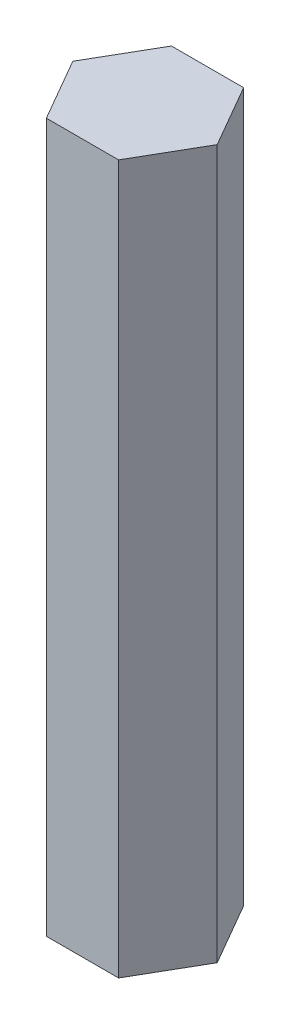
ISO-10303-21;
HEADER;
FILE_DESCRIPTION(('STEP AP214'),'2;1');
FILE_NAME('part.step','',(''),(''),'','','');
FILE_SCHEMA(('AUTOMOTIVE_DESIGN { 1 0 10303 214 1 1 1 1 }'));
ENDSEC;
DATA;
#1=APPLICATION_CONTEXT('core data for automotive mechanical design processes');
#2=APPLICATION_PROTOCOL_DEFINITION('international standard','automotive_design',2000,#1);
#3=PRODUCT_CONTEXT('',#1,'mechanical');
#4=PRODUCT('Part','Part','',(#3));
#5=PRODUCT_RELATED_PRODUCT_CATEGORY('part','',(#4));
#6=PRODUCT_DEFINITION_FORMATION('','',#4);
#7=PRODUCT_DEFINITION_CONTEXT('part definition',#1,'design');
#8=PRODUCT_DEFINITION('design','',#6,#7);
#9=PRODUCT_DEFINITION_SHAPE('','',#8);
#10=(LENGTH_UNIT() NAMED_UNIT(*) SI_UNIT(.MILLI.,.METRE.));
#11=(NAMED_UNIT(*) PLANE_ANGLE_UNIT() SI_UNIT($,.RADIAN.));
#12=(NAMED_UNIT(*) SI_UNIT($,.STERADIAN.) SOLID_ANGLE_UNIT());
#13=UNCERTAINTY_MEASURE_WITH_UNIT(LENGTH_MEASURE(1.E-05),#10,'distance_accuracy_value','');
#14=(GEOMETRIC_REPRESENTATION_CONTEXT(3) GLOBAL_UNCERTAINTY_ASSIGNED_CONTEXT((#13)) GLOBAL_UNIT_ASSIGNED_CONTEXT((#10,
#11,#12)) REPRESENTATION_CONTEXT('',''));
#15=CARTESIAN_POINT('',(0.,0.,0.));
#16=DIRECTION('',(0.,0.,1.));
#17=DIRECTION('',(1.,0.,0.));
#18=AXIS2_PLACEMENT_3D('',#15,#16,#17);
#19=CARTESIAN_POINT('',(3.6661742093542,71.9582,6.34999999999996));
#20=DIRECTION('',(-0.866025403784442,0.,-0.499999999999995));
#21=DIRECTION('',(-0.499999999999995,0.,0.866025403784442));
#22=AXIS2_PLACEMENT_3D('',#19,#20,#21);
#23=PLANE('',#22);
#24=DIRECTION('',(0.499999999999995,0.,-0.866025403784442));
#25=VECTOR('',#24,1.);
#26=CARTESIAN_POINT('',(3.6661742093542,0.,6.34999999999996));
#27=LINE('',#26,#25);
#28=CARTESIAN_POINT('',(3.6661742093542,0.,6.34999999999996));
#29=VERTEX_POINT('',#28);
#30=CARTESIAN_POINT('',(7.33234841870825,0.,0.));
#31=VERTEX_POINT('',#30);
#32=EDGE_CURVE('E117',#29,#31,#27,.T.);
#33=ORIENTED_EDGE('',*,*,#32,.T.);
#34=DIRECTION('',(0.,-1.,0.));
#35=VECTOR('',#34,1.);
#36=CARTESIAN_POINT('',(7.33234841870825,71.9582,0.));
#37=LINE('',#36,#35);
#38=CARTESIAN_POINT('',(7.33234841870825,71.9582,0.));
#39=VERTEX_POINT('',#38);
#40=EDGE_CURVE('E11',#39,#31,#37,.T.);
#41=ORIENTED_EDGE('',*,*,#40,.F.);
#42=DIRECTION('',(0.499999999999995,0.,-0.866025403784442));
#43=VECTOR('',#42,1.);
#44=CARTESIAN_POINT('',(3.6661742093542,71.9582,6.34999999999996));
#45=LINE('',#44,#43);
#46=CARTESIAN_POINT('',(3.6661742093542,71.9582,6.34999999999996));
#47=VERTEX_POINT('',#46);
#48=EDGE_CURVE('E127',#47,#39,#45,.T.);
#49=ORIENTED_EDGE('',*,*,#48,.F.);
#50=DIRECTION('',(0.,-1.,0.));
#51=VECTOR('',#50,1.);
#52=CARTESIAN_POINT('',(3.6661742093542,71.9582,6.34999999999996));
#53=LINE('',#52,#51);
#54=EDGE_CURVE('E113',#47,#29,#53,.T.);
#55=ORIENTED_EDGE('',*,*,#54,.T.);
#56=EDGE_LOOP('',(#33,#41,#49,#55));
#57=FACE_BOUND('',#56,.T.);
#58=ADVANCED_FACE('F33',(#57),#23,.F.);
#59=CARTESIAN_POINT('',(7.33234841870825,71.9582,0.));
#60=DIRECTION('',(-0.866025403784438,0.,0.500000000000001));
#61=DIRECTION('',(0.500000000000001,0.,0.866025403784438));
#62=AXIS2_PLACEMENT_3D('',#59,#60,#61);
#63=PLANE('',#62);
#64=DIRECTION('',(-0.500000000000001,0.,-0.866025403784438));
#65=VECTOR('',#64,1.);
#66=CARTESIAN_POINT('',(7.33234841870825,0.,0.));
#67=LINE('',#66,#65);
#68=CARTESIAN_POINT('',(3.66617420935411,0.,-6.35000000000001));
#69=VERTEX_POINT('',#68);
#70=EDGE_CURVE('E120',#31,#69,#67,.T.);
#71=ORIENTED_EDGE('',*,*,#70,.T.);
#72=DIRECTION('',(0.,-1.,0.));
#73=VECTOR('',#72,1.);
#74=CARTESIAN_POINT('',(3.66617420935411,71.9582,-6.35000000000001));
#75=LINE('',#74,#73);
#76=CARTESIAN_POINT('',(3.66617420935411,71.9582,-6.35000000000001));
#77=VERTEX_POINT('',#76);
#78=EDGE_CURVE('E41',#77,#69,#75,.T.);
#79=ORIENTED_EDGE('',*,*,#78,.F.);
#80=DIRECTION('',(-0.500000000000001,0.,-0.866025403784438));
#81=VECTOR('',#80,1.);
#82=CARTESIAN_POINT('',(7.33234841870825,71.9582,0.));
#83=LINE('',#82,#81);
#84=EDGE_CURVE('E86',#39,#77,#83,.T.);
#85=ORIENTED_EDGE('',*,*,#84,.F.);
#86=ORIENTED_EDGE('',*,*,#40,.T.);
#87=EDGE_LOOP('',(#71,#79,#85,#86));
#88=FACE_BOUND('',#87,.T.);
#89=ADVANCED_FACE('F151',(#88),#63,.F.);
#90=CARTESIAN_POINT('',(3.66617420935411,71.9582,-6.35000000000001));
#91=DIRECTION('',(0.,0.,1.));
#92=DIRECTION('',(1.,0.,0.));
#93=AXIS2_PLACEMENT_3D('',#90,#91,#92);
#94=PLANE('',#93);
#95=DIRECTION('',(-1.,0.,0.));
#96=VECTOR('',#95,1.);
#97=CARTESIAN_POINT('',(3.66617420935411,0.,-6.35000000000001));
#98=LINE('',#97,#96);
#99=CARTESIAN_POINT('',(-3.66617420935416,0.,-6.34999999999999));
#100=VERTEX_POINT('',#99);
#101=EDGE_CURVE('E122',#69,#100,#98,.T.);
#102=ORIENTED_EDGE('',*,*,#101,.T.);
#103=DIRECTION('',(0.,-1.,0.));
#104=VECTOR('',#103,1.);
#105=CARTESIAN_POINT('',(-3.66617420935416,71.9582,-6.34999999999999));
#106=LINE('',#105,#104);
#107=CARTESIAN_POINT('',(-3.66617420935416,71.9582,-6.34999999999999));
#108=VERTEX_POINT('',#107);
#109=EDGE_CURVE('E108',#108,#100,#106,.T.);
#110=ORIENTED_EDGE('',*,*,#109,.F.);
#111=DIRECTION('',(-1.,0.,0.));
#112=VECTOR('',#111,1.);
#113=CARTESIAN_POINT('',(3.66617420935411,71.9582,-6.35000000000001));
#114=LINE('',#113,#112);
#115=EDGE_CURVE('E99',#77,#108,#114,.T.);
#116=ORIENTED_EDGE('',*,*,#115,.F.);
#117=ORIENTED_EDGE('',*,*,#78,.T.);
#118=EDGE_LOOP('',(#102,#110,#116,#117));
#119=FACE_BOUND('',#118,.T.);
#120=ADVANCED_FACE('F133',(#119),#94,.F.);
#121=CARTESIAN_POINT('',(-3.66617420935416,71.9582,-6.34999999999999));
#122=DIRECTION('',(0.866025403784442,0.,0.499999999999995));
#123=DIRECTION('',(0.499999999999995,0.,-0.866025403784442));
#124=AXIS2_PLACEMENT_3D('',#121,#122,#123);
#125=PLANE('',#124);
#126=DIRECTION('',(-0.499999999999995,0.,0.866025403784442));
#127=VECTOR('',#126,1.);
#128=CARTESIAN_POINT('',(-3.66617420935416,0.,-6.34999999999999));
#129=LINE('',#128,#127);
#130=CARTESIAN_POINT('',(-7.33234841870825,0.,0.));
#131=VERTEX_POINT('',#130);
#132=EDGE_CURVE('E107',#100,#131,#129,.T.);
#133=ORIENTED_EDGE('',*,*,#132,.T.);
#134=DIRECTION('',(0.,-1.,0.));
#135=VECTOR('',#134,1.);
#136=CARTESIAN_POINT('',(-7.33234841870825,71.9582,0.));
#137=LINE('',#136,#135);
#138=CARTESIAN_POINT('',(-7.33234841870825,71.9582,0.));
#139=VERTEX_POINT('',#138);
#140=EDGE_CURVE('E104',#139,#131,#137,.T.);
#141=ORIENTED_EDGE('',*,*,#140,.F.);
#142=DIRECTION('',(-0.499999999999995,0.,0.866025403784442));
#143=VECTOR('',#142,1.);
#144=CARTESIAN_POINT('',(-3.66617420935416,71.9582,-6.34999999999999));
#145=LINE('',#144,#143);
#146=EDGE_CURVE('E93',#108,#139,#145,.T.);
#147=ORIENTED_EDGE('',*,*,#146,.F.);
#148=ORIENTED_EDGE('',*,*,#109,.T.);
#149=EDGE_LOOP('',(#133,#141,#147,#148));
#150=FACE_BOUND('',#149,.T.);
#151=ADVANCED_FACE('F105',(#150),#125,.F.);
#152=CARTESIAN_POINT('',(-7.33234841870825,71.9582,0.));
#153=DIRECTION('',(0.866025403784434,0.,-0.500000000000007));
#154=DIRECTION('',(-0.500000000000007,0.,-0.866025403784434));
#155=AXIS2_PLACEMENT_3D('',#152,#153,#154);
#156=PLANE('',#155);
#157=DIRECTION('',(0.500000000000007,0.,0.866025403784434));
#158=VECTOR('',#157,1.);
#159=CARTESIAN_POINT('',(-7.33234841870825,0.,0.));
#160=LINE('',#159,#158);
#161=CARTESIAN_POINT('',(-3.66617420935407,0.,6.35000000000004));
#162=VERTEX_POINT('',#161);
#163=EDGE_CURVE('E72',#131,#162,#160,.T.);
#164=ORIENTED_EDGE('',*,*,#163,.T.);
#165=DIRECTION('',(0.,-1.,0.));
#166=VECTOR('',#165,1.);
#167=CARTESIAN_POINT('',(-3.66617420935407,71.9582,6.35000000000004));
#168=LINE('',#167,#166);
#169=CARTESIAN_POINT('',(-3.66617420935407,71.9582,6.35000000000004));
#170=VERTEX_POINT('',#169);
#171=EDGE_CURVE('E109',#170,#162,#168,.T.);
#172=ORIENTED_EDGE('',*,*,#171,.F.);
#173=DIRECTION('',(0.500000000000007,0.,0.866025403784434));
#174=VECTOR('',#173,1.);
#175=CARTESIAN_POINT('',(-7.33234841870825,71.9582,0.));
#176=LINE('',#175,#174);
#177=EDGE_CURVE('E97',#139,#170,#176,.T.);
#178=ORIENTED_EDGE('',*,*,#177,.F.);
#179=ORIENTED_EDGE('',*,*,#140,.T.);
#180=EDGE_LOOP('',(#164,#172,#178,#179));
#181=FACE_BOUND('',#180,.T.);
#182=ADVANCED_FACE('F111',(#181),#156,.F.);
#183=CARTESIAN_POINT('',(-3.66617420935407,71.9582,6.35000000000004));
#184=DIRECTION('',(0.,0.,-1.));
#185=DIRECTION('',(-1.,0.,0.));
#186=AXIS2_PLACEMENT_3D('',#183,#184,#185);
#187=PLANE('',#186);
#188=DIRECTION('',(1.,0.,0.));
#189=VECTOR('',#188,1.);
#190=CARTESIAN_POINT('',(-3.66617420935407,0.,6.35000000000004));
#191=LINE('',#190,#189);
#192=EDGE_CURVE('E78',#162,#29,#191,.T.);
#193=ORIENTED_EDGE('',*,*,#192,.T.);
#194=ORIENTED_EDGE('',*,*,#54,.F.);
#195=DIRECTION('',(1.,0.,0.));
#196=VECTOR('',#195,1.);
#197=CARTESIAN_POINT('',(-3.66617420935407,71.9582,6.35000000000004));
#198=LINE('',#197,#196);
#199=EDGE_CURVE('E49',#170,#47,#198,.T.);
#200=ORIENTED_EDGE('',*,*,#199,.F.);
#201=ORIENTED_EDGE('',*,*,#171,.T.);
#202=EDGE_LOOP('',(#193,#194,#200,#201));
#203=FACE_BOUND('',#202,.T.);
#204=ADVANCED_FACE('F140',(#203),#187,.F.);
#205=CARTESIAN_POINT('',(0.,71.9582,0.));
#206=DIRECTION('',(0.,1.,0.));
#207=DIRECTION('',(0.,0.,1.));
#208=AXIS2_PLACEMENT_3D('',#205,#206,#207);
#209=PLANE('',#208);
#210=ORIENTED_EDGE('',*,*,#48,.T.);
#211=ORIENTED_EDGE('',*,*,#84,.T.);
#212=ORIENTED_EDGE('',*,*,#115,.T.);
#213=ORIENTED_EDGE('',*,*,#146,.T.);
#214=ORIENTED_EDGE('',*,*,#177,.T.);
#215=ORIENTED_EDGE('',*,*,#199,.T.);
#216=EDGE_LOOP('',(#210,#211,#212,#213,#214,#215));
#217=FACE_BOUND('',#216,.T.);
#218=ADVANCED_FACE('F95',(#217),#209,.T.);
#219=CARTESIAN_POINT('',(0.,0.,0.));
#220=DIRECTION('',(0.,1.,0.));
#221=DIRECTION('',(0.,0.,1.));
#222=AXIS2_PLACEMENT_3D('',#219,#220,#221);
#223=PLANE('',#222);
#224=ORIENTED_EDGE('',*,*,#32,.F.);
#225=ORIENTED_EDGE('',*,*,#192,.F.);
#226=ORIENTED_EDGE('',*,*,#163,.F.);
#227=ORIENTED_EDGE('',*,*,#132,.F.);
#228=ORIENTED_EDGE('',*,*,#101,.F.);
#229=ORIENTED_EDGE('',*,*,#70,.F.);
#230=EDGE_LOOP('',(#224,#225,#226,#227,#228,#229));
#231=FACE_BOUND('',#230,.T.);
#232=ADVANCED_FACE('F136',(#231),#223,.F.);
#233=CLOSED_SHELL('',(#58,#89,#120,#151,#182,#204,#218,#232));
#234=MANIFOLD_SOLID_BREP('B2',#233);
#235=ADVANCED_BREP_SHAPE_REPRESENTATION('',(#18,#234),#14);
#236=SHAPE_DEFINITION_REPRESENTATION(#9,#235);
ENDSEC;
END-ISO-10303-21;
